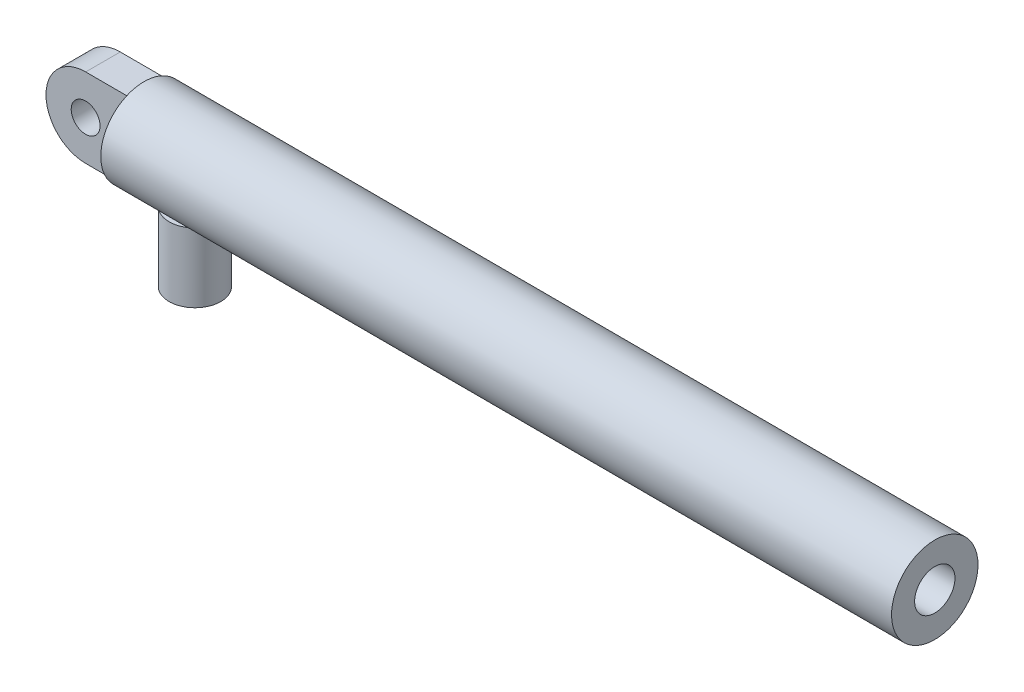
ISO-10303-21;
HEADER;
FILE_DESCRIPTION(('STEP AP214'),'2;1');
FILE_NAME('part.step','',(''),(''),'','','');
FILE_SCHEMA(('AUTOMOTIVE_DESIGN { 1 0 10303 214 1 1 1 1 }'));
ENDSEC;
DATA;
#1=APPLICATION_CONTEXT('core data for automotive mechanical design processes');
#2=APPLICATION_PROTOCOL_DEFINITION('international standard','automotive_design',2000,#1);
#3=PRODUCT_CONTEXT('',#1,'mechanical');
#4=PRODUCT('Part','Part','',(#3));
#5=PRODUCT_RELATED_PRODUCT_CATEGORY('part','',(#4));
#6=PRODUCT_DEFINITION_FORMATION('','',#4);
#7=PRODUCT_DEFINITION_CONTEXT('part definition',#1,'design');
#8=PRODUCT_DEFINITION('design','',#6,#7);
#9=PRODUCT_DEFINITION_SHAPE('','',#8);
#10=(LENGTH_UNIT() NAMED_UNIT(*) SI_UNIT(.MILLI.,.METRE.));
#11=(NAMED_UNIT(*) PLANE_ANGLE_UNIT() SI_UNIT($,.RADIAN.));
#12=(NAMED_UNIT(*) SI_UNIT($,.STERADIAN.) SOLID_ANGLE_UNIT());
#13=UNCERTAINTY_MEASURE_WITH_UNIT(LENGTH_MEASURE(1.E-05),#10,'distance_accuracy_value','');
#14=(GEOMETRIC_REPRESENTATION_CONTEXT(3) GLOBAL_UNCERTAINTY_ASSIGNED_CONTEXT((#13)) GLOBAL_UNIT_ASSIGNED_CONTEXT((#10,
#11,#12)) REPRESENTATION_CONTEXT('',''));
#15=CARTESIAN_POINT('',(0.,0.,0.));
#16=DIRECTION('',(0.,0.,1.));
#17=DIRECTION('',(1.,0.,0.));
#18=AXIS2_PLACEMENT_3D('',#15,#16,#17);
#19=CARTESIAN_POINT('',(88.1398910950954,1962.38795293142,310.000000000001));
#20=DIRECTION('',(0.999998110601927,-0.00194391166865434,0.));
#21=DIRECTION('',(-0.00194391166865434,-0.999998110601928,0.));
#22=AXIS2_PLACEMENT_3D('',#19,#20,#21);
#23=CYLINDRICAL_SURFACE('',#22,37.5);
#24=CARTESIAN_POINT('',(66.1399326618529,1962.43071898813,310.000000000001));
#25=DIRECTION('',(-0.999998110601927,0.00194391166865434,0.));
#26=DIRECTION('',(0.00194391166865434,0.999998110601928,0.));
#27=AXIS2_PLACEMENT_3D('',#24,#25,#26);
#28=CIRCLE('',#27,37.5);
#29=CARTESIAN_POINT('',(66.0731217441085,1928.06146621328,325.000000000001));
#30=VERTEX_POINT('',#29);
#31=CARTESIAN_POINT('',(66.2067435795973,1996.79997176297,325.000000000001));
#32=VERTEX_POINT('',#31);
#33=EDGE_CURVE('E123',#30,#32,#28,.T.);
#34=ORIENTED_EDGE('',*,*,#33,.F.);
#35=CARTESIAN_POINT('',(66.0731217441085,1928.06146621328,295.000000000001));
#36=VERTEX_POINT('',#35);
#37=EDGE_CURVE('E122',#36,#30,#28,.T.);
#38=ORIENTED_EDGE('',*,*,#37,.F.);
#39=CARTESIAN_POINT('',(66.2067435795973,1996.79997176297,295.000000000001));
#40=VERTEX_POINT('',#39);
#41=EDGE_CURVE('E248',#40,#36,#28,.T.);
#42=ORIENTED_EDGE('',*,*,#41,.F.);
#43=EDGE_CURVE('E127',#32,#40,#28,.T.);
#44=ORIENTED_EDGE('',*,*,#43,.F.);
#45=EDGE_LOOP('',(#34,#38,#42,#44));
#46=FACE_BOUND('',#45,.T.);
#47=CARTESIAN_POINT('',(752.138636534775,1961.09719558343,310.));
#48=DIRECTION('',(-0.999998110601927,0.00194391166865434,0.));
#49=DIRECTION('',(0.00194391166865434,0.999998110601928,0.));
#50=AXIS2_PLACEMENT_3D('',#47,#48,#49);
#51=CIRCLE('',#50,37.5);
#52=CARTESIAN_POINT('',(752.21153322235,1998.597124731,310.));
#53=VERTEX_POINT('',#52);
#54=EDGE_CURVE('E133',#53,#53,#51,.T.);
#55=ORIENTED_EDGE('',*,*,#54,.T.);
#56=EDGE_LOOP('',(#55));
#57=FACE_BOUND('',#56,.T.);
#58=DIRECTION('',(0.999998110601927,-0.00194391166865434,0.));
#59=VECTOR('',#58,1.);
#60=CARTESIAN_POINT('',(88.0730801773509,1928.01870015657,295.000000000001));
#61=LINE('',#60,#59);
#62=CARTESIAN_POINT('',(93.6625597853306,1928.00783468141,295.000000000001));
#63=VERTEX_POINT('',#62);
#64=CARTESIAN_POINT('',(127.203516075489,1927.94263390191,295.000000000001));
#65=VERTEX_POINT('',#64);
#66=EDGE_CURVE('E11',#63,#65,#61,.T.);
#67=ORIENTED_EDGE('',*,*,#66,.F.);
#68=CARTESIAN_POINT('',(93.6625597853306,1928.00783468141,325.000000000001));
#69=CARTESIAN_POINT('',(93.2657066855436,1927.81509472509,324.556720900096));
#70=CARTESIAN_POINT('',(92.8856864153294,1927.62540271984,324.096889787833));
#71=CARTESIAN_POINT('',(92.1614205829992,1927.25597272037,323.145635665241));
#72=CARTESIAN_POINT('',(91.8171974012046,1927.07624098571,322.654193198547));
#73=CARTESIAN_POINT('',(91.1653826329089,1926.72990858576,321.639056550323));
#74=CARTESIAN_POINT('',(90.8579984089642,1926.56338388782,321.115202864375));
#75=CARTESIAN_POINT('',(90.2847527443397,1926.2484202866,320.040130400425));
#76=CARTESIAN_POINT('',(90.0188837098914,1926.09997807685,319.488916651366));
#77=CARTESIAN_POINT('',(89.5302887467761,1925.82416475797,318.359518802385));
#78=CARTESIAN_POINT('',(89.3077575057244,1925.6968890932,317.781226845129));
#79=CARTESIAN_POINT('',(88.9100371165765,1925.46753237094,316.603642361721));
#80=CARTESIAN_POINT('',(88.7348505159652,1925.36545266919,316.004348707486));
#81=CARTESIAN_POINT('',(88.4347192604641,1925.18957669641,314.790977267259));
#82=CARTESIAN_POINT('',(88.3096390034244,1925.11570411458,314.176944215856));
#83=CARTESIAN_POINT('',(88.1110028286656,1924.99801147225,312.937779640195));
#84=CARTESIAN_POINT('',(88.0374406498426,1924.95418775986,312.312649474065));
#85=CARTESIAN_POINT('',(87.9474811499205,1924.90054502219,311.116141975543));
#86=CARTESIAN_POINT('',(87.9263570065117,1924.88791480801,310.545240418531));
#87=CARTESIAN_POINT('',(87.9276615407738,1924.88869449975,309.403522500315));
#88=CARTESIAN_POINT('',(87.9500875614402,1924.90210281704,308.832706136038));
#89=CARTESIAN_POINT('',(88.0381907213489,1924.95463104199,307.695411220392));
#90=CARTESIAN_POINT('',(88.1038844593175,1924.99376081711,307.128934418205));
#91=CARTESIAN_POINT('',(88.27763778877,1925.09676951482,306.004821989794));
#92=CARTESIAN_POINT('',(88.3856969598653,1925.16064819183,305.447186275896));
#93=CARTESIAN_POINT('',(88.6372488766285,1925.30836634635,304.368412740463));
#94=CARTESIAN_POINT('',(88.7790177678039,1925.39122916478,303.846736682915));
#95=CARTESIAN_POINT('',(89.0985331793143,1925.57646126228,302.8181069909));
#96=CARTESIAN_POINT('',(89.2762797046452,1925.67883054405,302.311153358478));
#97=CARTESIAN_POINT('',(89.6661331886947,1925.90108830432,301.314311068481));
#98=CARTESIAN_POINT('',(89.8782571371065,1926.02098544238,300.824430995045));
#99=CARTESIAN_POINT('',(90.3349160046699,1926.27593711554,299.864299193841));
#100=CARTESIAN_POINT('',(90.5794477298972,1926.41099015676,299.394045537802));
#101=CARTESIAN_POINT('',(91.2414401513243,1926.77128475684,298.223323245016));
#102=CARTESIAN_POINT('',(91.6803613880296,1927.00547133704,297.537527472025));
#103=CARTESIAN_POINT('',(92.3880876920506,1927.37196601648,296.552458866188));
#104=CARTESIAN_POINT('',(92.6318325494992,1927.49647570387,296.231805876936));
#105=CARTESIAN_POINT('',(93.1353302825759,1927.74946929001,295.604971730681));
#106=CARTESIAN_POINT('',(93.3950827512571,1927.87795308768,295.298790206132));
#107=CARTESIAN_POINT('',(93.6625597853306,1928.00783468141,295.000000000001));
#108=B_SPLINE_CURVE_WITH_KNOTS('',3,(#68,#69,#70,#71,#72,#73,#74,#75,#76,#77,#78,#79,#80,#81,
#82,#83,#84,#85,#86,#87,#88,#89,#90,#91,#92,#93,#94,#95,#96,#97,#98,#99,#100,#101,#102,#103,
#104,#105,#106,#107),.UNSPECIFIED.,.F.,.F.,(4,2,2,2,2,2,2,2,2,2,2,2,2,2,2,2,2,2,2,4),(0.,
1.87594742089727,3.75306071997188,5.64028783731779,7.52716934631215,9.42234113275371,
11.3176148728853,13.2077242336482,15.0976038454355,16.8096899193566,18.5216715418299,
20.2343103119636,21.9469320881553,23.5858954528662,25.2248590451666,26.8646351149656,
28.5042496978761,31.0401351017162,32.3044261667614,33.568685104123),.UNSPECIFIED.);
#109=CARTESIAN_POINT('',(93.6625597853306,1928.00783468141,325.000000000001));
#110=VERTEX_POINT('',#109);
#111=EDGE_CURVE('E24',#110,#63,#108,.T.);
#112=ORIENTED_EDGE('',*,*,#111,.F.);
#113=DIRECTION('',(0.999998110601927,-0.00194391166865434,0.));
#114=VECTOR('',#113,1.);
#115=CARTESIAN_POINT('',(88.0730801773509,1928.01870015657,325.000000000001));
#116=LINE('',#115,#114);
#117=CARTESIAN_POINT('',(127.203516075489,1927.94263390191,325.000000000001));
#118=VERTEX_POINT('',#117);
#119=EDGE_CURVE('E75',#118,#110,#116,.F.);
#120=ORIENTED_EDGE('',*,*,#119,.F.);
#121=CARTESIAN_POINT('',(127.203516075489,1927.94263390191,295.000000000001));
#122=CARTESIAN_POINT('',(127.599616838541,1927.74835251041,295.443279099905));
#123=CARTESIAN_POINT('',(127.978896749108,1927.55718448989,295.903110212168));
#124=CARTESIAN_POINT('',(128.701720831878,1927.18494147014,296.85436433476));
#125=CARTESIAN_POINT('',(129.045242648264,1927.00387281743,297.345806801454));
#126=CARTESIAN_POINT('',(129.695706013771,1926.65500889902,298.360943449678));
#127=CARTESIAN_POINT('',(130.00244049725,1926.48729040631,298.884797135626));
#128=CARTESIAN_POINT('',(130.574457308996,1926.1701005118,299.959869599577));
#129=CARTESIAN_POINT('',(130.83974721812,1926.02062577403,300.511083348635));
#130=CARTESIAN_POINT('',(131.327266177205,1925.74291497232,301.640481197616));
#131=CARTESIAN_POINT('',(131.549300912093,1925.61477510893,302.218773154873));
#132=CARTESIAN_POINT('',(131.946126598702,1925.38387385635,303.39635763828));
#133=CARTESIAN_POINT('',(132.120915008229,1925.28111383281,303.995651292516));
#134=CARTESIAN_POINT('',(132.420360222043,1925.10407233414,305.209022732742));
#135=CARTESIAN_POINT('',(132.545152330773,1925.02971402159,305.823055784146));
#136=CARTESIAN_POINT('',(132.743329436985,1924.91125000783,307.062220359807));
#137=CARTESIAN_POINT('',(132.816720681326,1924.86714063043,307.687350525936));
#138=CARTESIAN_POINT('',(132.906470948278,1924.81314855218,308.883858024458));
#139=CARTESIAN_POINT('',(132.927545828091,1924.80043630667,309.454759581471));
#140=CARTESIAN_POINT('',(132.926244334986,1924.80122106431,310.596477499687));
#141=CARTESIAN_POINT('',(132.903870612876,1924.81471646851,311.167293863963));
#142=CARTESIAN_POINT('',(132.815972338888,1924.86758682535,312.304588779609));
#143=CARTESIAN_POINT('',(132.750431226771,1924.9069717099,312.871065581796));
#144=CARTESIAN_POINT('',(132.577079689336,1925.01065515009,313.995178010207));
#145=CARTESIAN_POINT('',(132.469269683449,1925.07495345851,314.552813724105));
#146=CARTESIAN_POINT('',(132.218293968814,1925.2236484842,315.631587259539));
#147=CARTESIAN_POINT('',(132.07684830446,1925.30706184775,316.153263317086));
#148=CARTESIAN_POINT('',(131.758055456025,1925.49353476246,317.181893009101));
#149=CARTESIAN_POINT('',(131.58070826696,1925.59659431636,317.688846641523));
#150=CARTESIAN_POINT('',(131.191721826536,1925.8203660755,318.685688931521));
#151=CARTESIAN_POINT('',(130.980065619279,1925.94108700631,319.175569004956));
#152=CARTESIAN_POINT('',(130.524401408146,1926.1978121583,320.135700806161));
#153=CARTESIAN_POINT('',(130.280396592362,1926.3338148732,320.605954462199));
#154=CARTESIAN_POINT('',(129.619809933107,1926.69668045504,321.776676754985));
#155=CARTESIAN_POINT('',(129.181802487917,1926.93257171035,322.462472527976));
#156=CARTESIAN_POINT('',(128.475506396474,1927.30181512962,323.447541133813));
#157=CARTESIAN_POINT('',(128.232247451901,1927.42727151118,323.768194123065));
#158=CARTESIAN_POINT('',(127.729737116562,1927.68222069184,324.39502826932));
#159=CARTESIAN_POINT('',(127.470486132345,1927.81171338828,324.701209793869));
#160=CARTESIAN_POINT('',(127.203516075489,1927.94263390191,325.000000000001));
#161=B_SPLINE_CURVE_WITH_KNOTS('',3,(#121,#122,#123,#124,#125,#126,#127,#128,#129,#130,#131,
#132,#133,#134,#135,#136,#137,#138,#139,#140,#141,#142,#143,#144,#145,#146,#147,#148,#149,#150,
#151,#152,#153,#154,#155,#156,#157,#158,#159,#160),.UNSPECIFIED.,.F.,.F.,(4,2,2,2,2,2,2,2,2,2,2,
2,2,2,2,2,2,2,2,4),(0.,1.87594742089733,3.75306071997195,5.64028783731773,7.52716934631227,
9.42234113275377,11.3176148728853,13.2077242336483,15.0976038454355,16.8096899193565,
18.5216715418299,20.2343103119634,21.9469320881553,23.5858954528662,25.2248590451667,
26.8646351149657,28.5042496978762,31.0401351017161,32.3044261667613,33.568685104123),.UNSPECIFIED.);
#162=EDGE_CURVE('E34',#65,#118,#161,.T.);
#163=ORIENTED_EDGE('',*,*,#162,.F.);
#164=EDGE_LOOP('',(#67,#112,#120,#163));
#165=FACE_BOUND('',#164,.T.);
#166=ADVANCED_FACE('F16',(#46,#57,#165),#23,.T.);
#167=CARTESIAN_POINT('',(66.1399326618529,1962.43071898813,310.000000000001));
#168=DIRECTION('',(-0.999998110601927,0.00194391166865434,0.));
#169=DIRECTION('',(0.00194391166865434,0.999998110601928,0.));
#170=AXIS2_PLACEMENT_3D('',#167,#168,#169);
#171=PLANE('',#170);
#172=DIRECTION('',(0.,0.,1.));
#173=VECTOR('',#172,1.);
#174=CARTESIAN_POINT('',(66.0731217441085,1928.06146621328,325.000000000001));
#175=LINE('',#174,#173);
#176=EDGE_CURVE('E106',#36,#30,#175,.T.);
#177=ORIENTED_EDGE('',*,*,#176,.F.);
#178=ORIENTED_EDGE('',*,*,#37,.T.);
#179=EDGE_LOOP('',(#177,#178));
#180=FACE_BOUND('',#179,.T.);
#181=ADVANCED_FACE('F205',(#180),#171,.T.);
#182=ORIENTED_EDGE('',*,*,#43,.T.);
#183=DIRECTION('',(0.,0.,-1.));
#184=VECTOR('',#183,1.);
#185=CARTESIAN_POINT('',(66.2067435795973,1996.79997176297,325.000000000001));
#186=LINE('',#185,#184);
#187=EDGE_CURVE('E111',#32,#40,#186,.T.);
#188=ORIENTED_EDGE('',*,*,#187,.F.);
#189=EDGE_LOOP('',(#182,#188));
#190=FACE_BOUND('',#189,.T.);
#191=ADVANCED_FACE('F220',(#190),#171,.T.);
#192=DIRECTION('',(0.00194391166865434,0.999998110601928,0.));
#193=VECTOR('',#192,1.);
#194=CARTESIAN_POINT('',(66.0731217441085,1928.06146621328,295.000000000001));
#195=LINE('',#194,#193);
#196=EDGE_CURVE('E95',#36,#40,#195,.T.);
#197=ORIENTED_EDGE('',*,*,#196,.T.);
#198=ORIENTED_EDGE('',*,*,#41,.T.);
#199=EDGE_LOOP('',(#197,#198));
#200=FACE_BOUND('',#199,.T.);
#201=ADVANCED_FACE('F206',(#200),#171,.T.);
#202=CARTESIAN_POINT('',(752.138636534775,1961.09719558343,310.));
#203=DIRECTION('',(-0.999998110601927,0.00194391166865434,0.));
#204=DIRECTION('',(0.00194391166865434,0.999998110601928,0.));
#205=AXIS2_PLACEMENT_3D('',#202,#203,#204);
#206=PLANE('',#205);
#207=ORIENTED_EDGE('',*,*,#54,.F.);
#208=EDGE_LOOP('',(#207));
#209=FACE_BOUND('',#208,.T.);
#210=CARTESIAN_POINT('',(752.138636534775,1961.09719558343,310.));
#211=DIRECTION('',(-0.999998110601927,0.00194391166865434,0.));
#212=DIRECTION('',(0.00194391166865434,0.999998110601928,0.));
#213=AXIS2_PLACEMENT_3D('',#210,#211,#212);
#214=CIRCLE('',#213,17.5);
#215=CARTESIAN_POINT('',(752.172654988977,1978.59716251896,310.));
#216=VERTEX_POINT('',#215);
#217=EDGE_CURVE('E130',#216,#216,#214,.T.);
#218=ORIENTED_EDGE('',*,*,#217,.T.);
#219=EDGE_LOOP('',(#218));
#220=FACE_BOUND('',#219,.T.);
#221=ADVANCED_FACE('F212',(#209,#220),#206,.F.);
#222=CARTESIAN_POINT('',(88.1398910950954,1962.38795293142,310.000000000001));
#223=DIRECTION('',(0.999998110601927,-0.00194391166865434,0.));
#224=DIRECTION('',(-0.00194391166865434,-0.999998110601928,0.));
#225=AXIS2_PLACEMENT_3D('',#222,#223,#224);
#226=CYLINDRICAL_SURFACE('',#225,17.5);
#227=CARTESIAN_POINT('',(88.1398910950954,1962.38795293142,310.000000000001));
#228=DIRECTION('',(-0.999998110601927,0.00194391166865434,0.));
#229=DIRECTION('',(0.00194391166865434,0.999998110601928,0.));
#230=AXIS2_PLACEMENT_3D('',#227,#228,#229);
#231=CIRCLE('',#230,17.5);
#232=CARTESIAN_POINT('',(88.1739095492968,1979.88791986695,310.000000000001));
#233=VERTEX_POINT('',#232);
#234=EDGE_CURVE('E126',#233,#233,#231,.T.);
#235=ORIENTED_EDGE('',*,*,#234,.T.);
#236=EDGE_LOOP('',(#235));
#237=FACE_BOUND('',#236,.T.);
#238=ORIENTED_EDGE('',*,*,#217,.F.);
#239=EDGE_LOOP('',(#238));
#240=FACE_BOUND('',#239,.T.);
#241=ADVANCED_FACE('F209',(#237,#240),#226,.F.);
#242=CARTESIAN_POINT('',(88.1398910950954,1962.38795293142,310.000000000001));
#243=DIRECTION('',(-0.999998110601927,0.00194391166865434,0.));
#244=DIRECTION('',(0.00194391166865434,0.999998110601928,0.));
#245=AXIS2_PLACEMENT_3D('',#242,#243,#244);
#246=PLANE('',#245);
#247=ORIENTED_EDGE('',*,*,#234,.F.);
#248=EDGE_LOOP('',(#247));
#249=FACE_BOUND('',#248,.T.);
#250=ADVANCED_FACE('F203',(#249),#246,.F.);
#251=DIRECTION('',(0.00194391166865434,0.999998110601928,0.));
#252=VECTOR('',#251,1.);
#253=CARTESIAN_POINT('',(66.0731217441085,1928.06146621328,325.000000000001));
#254=LINE('',#253,#252);
#255=EDGE_CURVE('E114',#30,#32,#254,.T.);
#256=ORIENTED_EDGE('',*,*,#255,.F.);
#257=ORIENTED_EDGE('',*,*,#33,.T.);
#258=EDGE_LOOP('',(#256,#257));
#259=FACE_BOUND('',#258,.T.);
#260=ADVANCED_FACE('F199',(#259),#171,.T.);
#261=CARTESIAN_POINT('',(-3.92674599802634,1928.19754003009,325.000000000001));
#262=DIRECTION('',(0.00194391166865434,0.999998110601928,0.));
#263=DIRECTION('',(0.999998110601927,-0.00194391166865434,0.));
#264=AXIS2_PLACEMENT_3D('',#261,#262,#263);
#265=PLANE('',#264);
#266=DIRECTION('',(0.999998110601927,-0.00194391166865434,0.));
#267=VECTOR('',#266,1.);
#268=CARTESIAN_POINT('',(-3.92674599802634,1928.19754003009,325.000000000001));
#269=LINE('',#268,#267);
#270=CARTESIAN_POINT('',(30.4331890822558,1928.13074722515,325.000000000001));
#271=VERTEX_POINT('',#270);
#272=EDGE_CURVE('E120',#271,#30,#269,.T.);
#273=ORIENTED_EDGE('',*,*,#272,.F.);
#274=DIRECTION('',(0.,0.,1.));
#275=VECTOR('',#274,1.);
#276=CARTESIAN_POINT('',(30.4331890822558,1928.13074722515,325.000000000001));
#277=LINE('',#276,#275);
#278=CARTESIAN_POINT('',(30.4331890822558,1928.13074722515,295.000000000001));
#279=VERTEX_POINT('',#278);
#280=EDGE_CURVE('E84',#271,#279,#277,.F.);
#281=ORIENTED_EDGE('',*,*,#280,.T.);
#282=DIRECTION('',(0.999998110601927,-0.00194391166865434,0.));
#283=VECTOR('',#282,1.);
#284=CARTESIAN_POINT('',(-3.92674599802634,1928.19754003009,295.000000000001));
#285=LINE('',#284,#283);
#286=EDGE_CURVE('E100',#279,#36,#285,.T.);
#287=ORIENTED_EDGE('',*,*,#286,.T.);
#288=ORIENTED_EDGE('',*,*,#176,.T.);
#289=EDGE_LOOP('',(#273,#281,#287,#288));
#290=FACE_BOUND('',#289,.T.);
#291=ADVANCED_FACE('F195',(#290),#265,.F.);
#292=CARTESIAN_POINT('',(-3.92674599802634,1928.19754003009,325.000000000001));
#293=DIRECTION('',(0.,0.,-1.));
#294=DIRECTION('',(-0.999998110601927,0.00194391166865434,0.));
#295=AXIS2_PLACEMENT_3D('',#292,#293,#294);
#296=PLANE('',#295);
#297=CARTESIAN_POINT('',(30.5000000000002,1962.5,325.000000000001));
#298=DIRECTION('',(0.,0.,-1.));
#299=DIRECTION('',(-0.999998110601927,0.00194391166865434,0.));
#300=AXIS2_PLACEMENT_3D('',#297,#298,#299);
#301=CIRCLE('',#300,12.5);
#302=CARTESIAN_POINT('',(18.0000236174761,1962.52429889586,325.000000000001));
#303=VERTEX_POINT('',#302);
#304=EDGE_CURVE('E92',#303,#303,#301,.T.);
#305=ORIENTED_EDGE('',*,*,#304,.T.);
#306=EDGE_LOOP('',(#305));
#307=FACE_BOUND('',#306,.T.);
#308=DIRECTION('',(0.999998110601927,-0.00194391166865434,0.));
#309=VECTOR('',#308,1.);
#310=CARTESIAN_POINT('',(-3.79312416253752,1996.93604557978,325.000000000001));
#311=LINE('',#310,#309);
#312=CARTESIAN_POINT('',(30.5668109177446,1996.86925277485,325.000000000001));
#313=VERTEX_POINT('',#312);
#314=EDGE_CURVE('E110',#313,#32,#311,.T.);
#315=ORIENTED_EDGE('',*,*,#314,.F.);
#316=CARTESIAN_POINT('',(30.5000181128096,1962.50931769456,325.000000000001));
#317=DIRECTION('',(0.,0.,-1.));
#318=DIRECTION('',(-0.999998110601927,0.00194391166865434,0.));
#319=AXIS2_PLACEMENT_3D('',#316,#317,#318);
#320=CIRCLE('',#319,34.36);
#321=CARTESIAN_POINT('',(-3.85991696747257,1962.5761104995,325.000000000001));
#322=VERTEX_POINT('',#321);
#323=EDGE_CURVE('E150',#313,#322,#320,.F.);
#324=ORIENTED_EDGE('',*,*,#323,.T.);
#325=DIRECTION('',(0.00194391166865434,0.999998110601928,0.));
#326=VECTOR('',#325,1.);
#327=CARTESIAN_POINT('',(-3.92674599802634,1928.19754003009,325.000000000001));
#328=LINE('',#327,#326);
#329=CARTESIAN_POINT('',(-3.85995319309129,1962.55747511037,325.000000000001));
#330=VERTEX_POINT('',#329);
#331=EDGE_CURVE('E107',#330,#322,#328,.T.);
#332=ORIENTED_EDGE('',*,*,#331,.F.);
#333=CARTESIAN_POINT('',(30.4999818871908,1962.49068230543,325.000000000001));
#334=DIRECTION('',(0.,0.,-1.));
#335=DIRECTION('',(-0.999998110601927,0.00194391166865434,0.));
#336=AXIS2_PLACEMENT_3D('',#333,#334,#335);
#337=CIRCLE('',#336,34.36);
#338=EDGE_CURVE('E148',#330,#271,#337,.F.);
#339=ORIENTED_EDGE('',*,*,#338,.T.);
#340=ORIENTED_EDGE('',*,*,#272,.T.);
#341=ORIENTED_EDGE('',*,*,#255,.T.);
#342=EDGE_LOOP('',(#315,#324,#332,#339,#340,#341));
#343=FACE_BOUND('',#342,.T.);
#344=ADVANCED_FACE('F191',(#307,#343),#296,.F.);
#345=CARTESIAN_POINT('',(-3.79312416253752,1996.93604557978,325.000000000001));
#346=DIRECTION('',(-0.00194391166865434,-0.999998110601928,0.));
#347=DIRECTION('',(-0.999998110601927,0.00194391166865434,0.));
#348=AXIS2_PLACEMENT_3D('',#345,#346,#347);
#349=PLANE('',#348);
#350=DIRECTION('',(0.999998110601927,-0.00194391166865434,0.));
#351=VECTOR('',#350,1.);
#352=CARTESIAN_POINT('',(-3.79312416253752,1996.93604557978,295.000000000001));
#353=LINE('',#352,#351);
#354=CARTESIAN_POINT('',(30.5668109177446,1996.86925277485,295.000000000001));
#355=VERTEX_POINT('',#354);
#356=EDGE_CURVE('E104',#355,#40,#353,.T.);
#357=ORIENTED_EDGE('',*,*,#356,.F.);
#358=DIRECTION('',(0.,0.,-1.));
#359=VECTOR('',#358,1.);
#360=CARTESIAN_POINT('',(30.5668109177446,1996.86925277485,325.000000000001));
#361=LINE('',#360,#359);
#362=EDGE_CURVE('E146',#355,#313,#361,.F.);
#363=ORIENTED_EDGE('',*,*,#362,.T.);
#364=ORIENTED_EDGE('',*,*,#314,.T.);
#365=ORIENTED_EDGE('',*,*,#187,.T.);
#366=EDGE_LOOP('',(#357,#363,#364,#365));
#367=FACE_BOUND('',#366,.T.);
#368=ADVANCED_FACE('F187',(#367),#349,.F.);
#369=CARTESIAN_POINT('',(-3.85993508028193,1962.56679280493,310.000000000001));
#370=DIRECTION('',(0.999998110601927,-0.00194391166865434,0.));
#371=DIRECTION('',(-0.00194391166865434,-0.999998110601928,0.));
#372=AXIS2_PLACEMENT_3D('',#369,#370,#371);
#373=PLANE('',#372);
#374=ORIENTED_EDGE('',*,*,#331,.T.);
#375=DIRECTION('',(0.,0.,-1.));
#376=VECTOR('',#375,1.);
#377=CARTESIAN_POINT('',(-3.85991696747257,1962.5761104995,310.000000000001));
#378=LINE('',#377,#376);
#379=CARTESIAN_POINT('',(-3.85991696747257,1962.5761104995,295.000000000001));
#380=VERTEX_POINT('',#379);
#381=EDGE_CURVE('E139',#322,#380,#378,.T.);
#382=ORIENTED_EDGE('',*,*,#381,.T.);
#383=DIRECTION('',(0.00194391166865434,0.999998110601928,0.));
#384=VECTOR('',#383,1.);
#385=CARTESIAN_POINT('',(-3.92674599802634,1928.19754003009,295.000000000001));
#386=LINE('',#385,#384);
#387=CARTESIAN_POINT('',(-3.85995319309129,1962.55747511037,295.000000000001));
#388=VERTEX_POINT('',#387);
#389=EDGE_CURVE('E97',#388,#380,#386,.T.);
#390=ORIENTED_EDGE('',*,*,#389,.F.);
#391=DIRECTION('',(0.,0.,1.));
#392=VECTOR('',#391,1.);
#393=CARTESIAN_POINT('',(-3.85995319309129,1962.55747511037,310.000000000001));
#394=LINE('',#393,#392);
#395=EDGE_CURVE('E136',#388,#330,#394,.T.);
#396=ORIENTED_EDGE('',*,*,#395,.T.);
#397=EDGE_LOOP('',(#374,#382,#390,#396));
#398=FACE_BOUND('',#397,.T.);
#399=ADVANCED_FACE('F183',(#398),#373,.F.);
#400=CARTESIAN_POINT('',(-3.92674599802634,1928.19754003009,295.000000000001));
#401=DIRECTION('',(0.,0.,-1.));
#402=DIRECTION('',(-0.999998110601927,0.00194391166865434,0.));
#403=AXIS2_PLACEMENT_3D('',#400,#401,#402);
#404=PLANE('',#403);
#405=CARTESIAN_POINT('',(30.5000000000002,1962.5,295.000000000001));
#406=DIRECTION('',(0.,0.,-1.));
#407=DIRECTION('',(-0.999998110601927,0.00194391166865434,0.));
#408=AXIS2_PLACEMENT_3D('',#405,#406,#407);
#409=CIRCLE('',#408,12.5);
#410=CARTESIAN_POINT('',(18.0000236174761,1962.52429889586,295.000000000001));
#411=VERTEX_POINT('',#410);
#412=EDGE_CURVE('E96',#411,#411,#409,.T.);
#413=ORIENTED_EDGE('',*,*,#412,.F.);
#414=EDGE_LOOP('',(#413));
#415=FACE_BOUND('',#414,.T.);
#416=ORIENTED_EDGE('',*,*,#389,.T.);
#417=CARTESIAN_POINT('',(30.5000181128096,1962.50931769456,295.000000000001));
#418=DIRECTION('',(0.,0.,-1.));
#419=DIRECTION('',(-0.999998110601927,0.00194391166865434,0.));
#420=AXIS2_PLACEMENT_3D('',#417,#418,#419);
#421=CIRCLE('',#420,34.36);
#422=EDGE_CURVE('E144',#380,#355,#421,.T.);
#423=ORIENTED_EDGE('',*,*,#422,.T.);
#424=ORIENTED_EDGE('',*,*,#356,.T.);
#425=ORIENTED_EDGE('',*,*,#196,.F.);
#426=ORIENTED_EDGE('',*,*,#286,.F.);
#427=CARTESIAN_POINT('',(30.4999818871908,1962.49068230543,295.000000000001));
#428=DIRECTION('',(0.,0.,-1.));
#429=DIRECTION('',(-0.999998110601927,0.00194391166865434,0.));
#430=AXIS2_PLACEMENT_3D('',#427,#428,#429);
#431=CIRCLE('',#430,34.36);
#432=EDGE_CURVE('E142',#279,#388,#431,.T.);
#433=ORIENTED_EDGE('',*,*,#432,.T.);
#434=EDGE_LOOP('',(#416,#423,#424,#425,#426,#433));
#435=FACE_BOUND('',#434,.T.);
#436=ADVANCED_FACE('F179',(#415,#435),#404,.T.);
#437=CARTESIAN_POINT('',(30.5000181128096,1962.50931769456,310.000000000001));
#438=DIRECTION('',(0.,0.,-1.));
#439=DIRECTION('',(-0.999998110601927,0.00194391166865434,0.));
#440=AXIS2_PLACEMENT_3D('',#437,#438,#439);
#441=CYLINDRICAL_SURFACE('',#440,34.36);
#442=ORIENTED_EDGE('',*,*,#323,.F.);
#443=ORIENTED_EDGE('',*,*,#362,.F.);
#444=ORIENTED_EDGE('',*,*,#422,.F.);
#445=ORIENTED_EDGE('',*,*,#381,.F.);
#446=EDGE_LOOP('',(#442,#443,#444,#445));
#447=FACE_BOUND('',#446,.T.);
#448=ADVANCED_FACE('F182',(#447),#441,.T.);
#449=CARTESIAN_POINT('',(30.4999818871908,1962.49068230543,310.000000000001));
#450=DIRECTION('',(0.,0.,1.));
#451=DIRECTION('',(0.999998110601927,-0.00194391166865434,0.));
#452=AXIS2_PLACEMENT_3D('',#449,#450,#451);
#453=CYLINDRICAL_SURFACE('',#452,34.36);
#454=ORIENTED_EDGE('',*,*,#432,.F.);
#455=ORIENTED_EDGE('',*,*,#280,.F.);
#456=ORIENTED_EDGE('',*,*,#338,.F.);
#457=ORIENTED_EDGE('',*,*,#395,.F.);
#458=EDGE_LOOP('',(#454,#455,#456,#457));
#459=FACE_BOUND('',#458,.T.);
#460=ADVANCED_FACE('F18',(#459),#453,.T.);
#461=CARTESIAN_POINT('',(30.5000000000002,1962.5,395.000000000001));
#462=DIRECTION('',(0.,0.,-1.));
#463=DIRECTION('',(-0.999998110601927,0.00194391166865434,0.));
#464=AXIS2_PLACEMENT_3D('',#461,#462,#463);
#465=CYLINDRICAL_SURFACE('',#464,12.5);
#466=ORIENTED_EDGE('',*,*,#412,.T.);
#467=EDGE_LOOP('',(#466));
#468=FACE_BOUND('',#467,.T.);
#469=ORIENTED_EDGE('',*,*,#304,.F.);
#470=EDGE_LOOP('',(#469));
#471=FACE_BOUND('',#470,.T.);
#472=ADVANCED_FACE('F172',(#468,#471),#465,.F.);
#473=CARTESIAN_POINT('',(110.316403230291,1867.97534765554,310.000000000001));
#474=DIRECTION('',(0.00194391166865434,0.999998110601928,0.));
#475=DIRECTION('',(0.999998110601927,-0.00194391166865434,0.));
#476=AXIS2_PLACEMENT_3D('',#473,#474,#475);
#477=CYLINDRICAL_SURFACE('',#476,22.5);
#478=CARTESIAN_POINT('',(110.316403230291,1867.97534765554,310.000000000001));
#479=DIRECTION('',(-0.00194391166865434,-0.999998110601928,0.));
#480=DIRECTION('',(-0.999998110601927,0.00194391166865434,0.));
#481=AXIS2_PLACEMENT_3D('',#478,#479,#480);
#482=CIRCLE('',#481,22.5);
#483=CARTESIAN_POINT('',(87.8164457417473,1868.01908566809,310.000000000001));
#484=VERTEX_POINT('',#483);
#485=EDGE_CURVE('E89',#484,#484,#482,.T.);
#486=ORIENTED_EDGE('',*,*,#485,.F.);
#487=EDGE_LOOP('',(#486));
#488=FACE_BOUND('',#487,.T.);
#489=CARTESIAN_POINT('',(110.43303793041,1927.97523429166,310.000000000001));
#490=DIRECTION('',(-0.00194391166865434,-0.999998110601928,0.));
#491=DIRECTION('',(-0.999998110601927,0.00194391166865434,0.));
#492=AXIS2_PLACEMENT_3D('',#489,#490,#491);
#493=CIRCLE('',#492,22.5);
#494=EDGE_CURVE('E83',#118,#110,#493,.T.);
#495=ORIENTED_EDGE('',*,*,#494,.T.);
#496=ORIENTED_EDGE('',*,*,#111,.T.);
#497=EDGE_CURVE('E87',#63,#65,#493,.T.);
#498=ORIENTED_EDGE('',*,*,#497,.T.);
#499=ORIENTED_EDGE('',*,*,#162,.T.);
#500=EDGE_LOOP('',(#495,#496,#498,#499));
#501=FACE_BOUND('',#500,.T.);
#502=ADVANCED_FACE('F86',(#488,#501),#477,.T.);
#503=CARTESIAN_POINT('',(110.43303793041,1927.97523429166,310.000000000001));
#504=DIRECTION('',(-0.00194391166865434,-0.999998110601928,0.));
#505=DIRECTION('',(-0.999998110601927,0.00194391166865434,0.));
#506=AXIS2_PLACEMENT_3D('',#503,#504,#505);
#507=PLANE('',#506);
#508=ORIENTED_EDGE('',*,*,#497,.F.);
#509=ORIENTED_EDGE('',*,*,#66,.T.);
#510=EDGE_LOOP('',(#508,#509));
#511=FACE_BOUND('',#510,.T.);
#512=ADVANCED_FACE('F171',(#511),#507,.F.);
#513=ORIENTED_EDGE('',*,*,#494,.F.);
#514=ORIENTED_EDGE('',*,*,#119,.T.);
#515=EDGE_LOOP('',(#513,#514));
#516=FACE_BOUND('',#515,.T.);
#517=ADVANCED_FACE('F82',(#516),#507,.F.);
#518=CARTESIAN_POINT('',(110.316403230291,1867.97534765554,310.000000000001));
#519=DIRECTION('',(-0.00194391166865434,-0.999998110601928,0.));
#520=DIRECTION('',(-0.999998110601927,0.00194391166865434,0.));
#521=AXIS2_PLACEMENT_3D('',#518,#519,#520);
#522=PLANE('',#521);
#523=ORIENTED_EDGE('',*,*,#485,.T.);
#524=EDGE_LOOP('',(#523));
#525=FACE_BOUND('',#524,.T.);
#526=ADVANCED_FACE('F288',(#525),#522,.T.);
#527=CLOSED_SHELL('',(#166,#181,#191,#201,#221,#241,#250,#260,#291,#344,#368,#399,#436,#448,
#460,#472,#502,#512,#517,#526));
#528=MANIFOLD_SOLID_BREP('B1',#527);
#529=ADVANCED_BREP_SHAPE_REPRESENTATION('',(#18,#528),#14);
#530=SHAPE_DEFINITION_REPRESENTATION(#9,#529);
ENDSEC;
END-ISO-10303-21;
